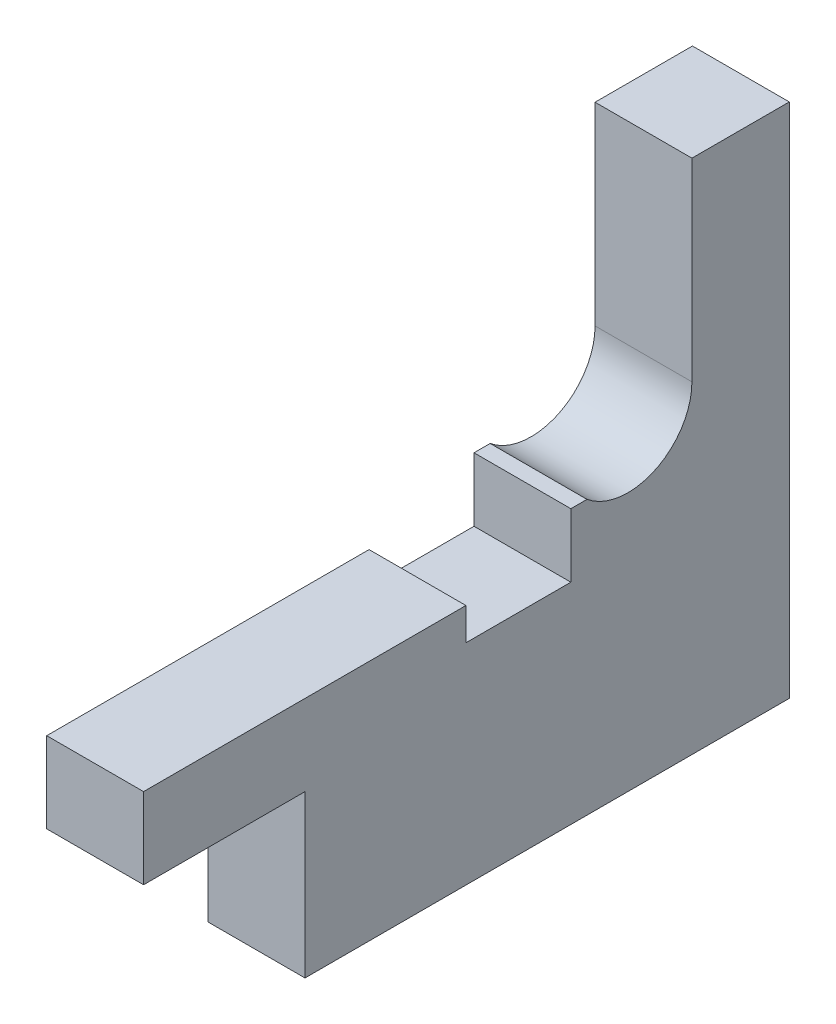
ISO-10303-21;
HEADER;
FILE_DESCRIPTION(('STEP AP214'),'2;1');
FILE_NAME('part.step','',(''),(''),'','','');
FILE_SCHEMA(('AUTOMOTIVE_DESIGN { 1 0 10303 214 1 1 1 1 }'));
ENDSEC;
DATA;
#1=APPLICATION_CONTEXT('core data for automotive mechanical design processes');
#2=APPLICATION_PROTOCOL_DEFINITION('international standard','automotive_design',2000,#1);
#3=PRODUCT_CONTEXT('',#1,'mechanical');
#4=PRODUCT('Part','Part','',(#3));
#5=PRODUCT_RELATED_PRODUCT_CATEGORY('part','',(#4));
#6=PRODUCT_DEFINITION_FORMATION('','',#4);
#7=PRODUCT_DEFINITION_CONTEXT('part definition',#1,'design');
#8=PRODUCT_DEFINITION('design','',#6,#7);
#9=PRODUCT_DEFINITION_SHAPE('','',#8);
#10=(LENGTH_UNIT() NAMED_UNIT(*) SI_UNIT(.MILLI.,.METRE.));
#11=(NAMED_UNIT(*) PLANE_ANGLE_UNIT() SI_UNIT($,.RADIAN.));
#12=(NAMED_UNIT(*) SI_UNIT($,.STERADIAN.) SOLID_ANGLE_UNIT());
#13=UNCERTAINTY_MEASURE_WITH_UNIT(LENGTH_MEASURE(1.E-05),#10,'distance_accuracy_value','');
#14=(GEOMETRIC_REPRESENTATION_CONTEXT(3) GLOBAL_UNCERTAINTY_ASSIGNED_CONTEXT((#13)) GLOBAL_UNIT_ASSIGNED_CONTEXT((#10,
#11,#12)) REPRESENTATION_CONTEXT('',''));
#15=CARTESIAN_POINT('',(0.,0.,0.));
#16=DIRECTION('',(0.,0.,1.));
#17=DIRECTION('',(1.,0.,0.));
#18=AXIS2_PLACEMENT_3D('',#15,#16,#17);
#19=CARTESIAN_POINT('',(6.,-3.05675481515937,3.53125));
#20=DIRECTION('',(0.,1.,0.));
#21=DIRECTION('',(0.,0.,1.));
#22=AXIS2_PLACEMENT_3D('',#19,#20,#21);
#23=PLANE('',#22);
#24=DIRECTION('',(0.,0.,-1.));
#25=VECTOR('',#24,1.);
#26=CARTESIAN_POINT('',(0.,-3.05675481515937,3.53125));
#27=LINE('',#26,#25);
#28=CARTESIAN_POINT('',(0.,-3.05675481515937,3.53125));
#29=VERTEX_POINT('',#28);
#30=CARTESIAN_POINT('',(0.,-3.05675481515937,2.53125));
#31=VERTEX_POINT('',#30);
#32=EDGE_CURVE('E178',#29,#31,#27,.T.);
#33=ORIENTED_EDGE('',*,*,#32,.F.);
#34=DIRECTION('',(-1.,0.,0.));
#35=VECTOR('',#34,1.);
#36=CARTESIAN_POINT('',(6.,-3.05675481515937,3.53125));
#37=LINE('',#36,#35);
#38=CARTESIAN_POINT('',(6.,-3.05675481515937,3.53125));
#39=VERTEX_POINT('',#38);
#40=EDGE_CURVE('E11',#39,#29,#37,.T.);
#41=ORIENTED_EDGE('',*,*,#40,.F.);
#42=DIRECTION('',(0.,0.,-1.));
#43=VECTOR('',#42,1.);
#44=CARTESIAN_POINT('',(6.,-3.05675481515937,3.53125));
#45=LINE('',#44,#43);
#46=CARTESIAN_POINT('',(6.,-3.05675481515937,2.53125));
#47=VERTEX_POINT('',#46);
#48=EDGE_CURVE('E226',#39,#47,#45,.T.);
#49=ORIENTED_EDGE('',*,*,#48,.T.);
#50=DIRECTION('',(-1.,0.,0.));
#51=VECTOR('',#50,1.);
#52=CARTESIAN_POINT('',(6.,-3.05675481515937,2.53125));
#53=LINE('',#52,#51);
#54=EDGE_CURVE('E48',#47,#31,#53,.T.);
#55=ORIENTED_EDGE('',*,*,#54,.T.);
#56=EDGE_LOOP('',(#33,#41,#49,#55));
#57=FACE_BOUND('',#56,.T.);
#58=ADVANCED_FACE('F45',(#57),#23,.T.);
#59=CARTESIAN_POINT('',(6.,-7.00000000000001,3.53125));
#60=DIRECTION('',(0.,0.,1.));
#61=DIRECTION('',(0.,-1.,0.));
#62=AXIS2_PLACEMENT_3D('',#59,#60,#61);
#63=PLANE('',#62);
#64=DIRECTION('',(0.,1.,0.));
#65=VECTOR('',#64,1.);
#66=CARTESIAN_POINT('',(0.,-7.00000000000001,3.53125));
#67=LINE('',#66,#65);
#68=CARTESIAN_POINT('',(0.,-7.00000000000001,3.53125));
#69=VERTEX_POINT('',#68);
#70=EDGE_CURVE('E223',#69,#29,#67,.T.);
#71=ORIENTED_EDGE('',*,*,#70,.F.);
#72=DIRECTION('',(-1.,0.,0.));
#73=VECTOR('',#72,1.);
#74=CARTESIAN_POINT('',(6.,-7.00000000000001,3.53125));
#75=LINE('',#74,#73);
#76=CARTESIAN_POINT('',(6.,-7.00000000000001,3.53125));
#77=VERTEX_POINT('',#76);
#78=EDGE_CURVE('E55',#77,#69,#75,.T.);
#79=ORIENTED_EDGE('',*,*,#78,.F.);
#80=DIRECTION('',(0.,1.,0.));
#81=VECTOR('',#80,1.);
#82=CARTESIAN_POINT('',(6.,-7.00000000000001,3.53125));
#83=LINE('',#82,#81);
#84=EDGE_CURVE('E164',#77,#39,#83,.T.);
#85=ORIENTED_EDGE('',*,*,#84,.T.);
#86=ORIENTED_EDGE('',*,*,#40,.T.);
#87=EDGE_LOOP('',(#71,#79,#85,#86));
#88=FACE_BOUND('',#87,.T.);
#89=ADVANCED_FACE('F259',(#88),#63,.T.);
#90=CARTESIAN_POINT('',(6.,-7.00000000000001,10.03125));
#91=DIRECTION('',(0.,1.,0.));
#92=DIRECTION('',(0.,0.,1.));
#93=AXIS2_PLACEMENT_3D('',#90,#91,#92);
#94=PLANE('',#93);
#95=DIRECTION('',(0.,0.,-1.));
#96=VECTOR('',#95,1.);
#97=CARTESIAN_POINT('',(0.,-7.00000000000001,10.03125));
#98=LINE('',#97,#96);
#99=CARTESIAN_POINT('',(0.,-7.00000000000001,10.03125));
#100=VERTEX_POINT('',#99);
#101=EDGE_CURVE('E150',#100,#69,#98,.T.);
#102=ORIENTED_EDGE('',*,*,#101,.F.);
#103=DIRECTION('',(-1.,0.,0.));
#104=VECTOR('',#103,1.);
#105=CARTESIAN_POINT('',(6.,-7.00000000000001,10.03125));
#106=LINE('',#105,#104);
#107=CARTESIAN_POINT('',(6.,-7.00000000000001,10.03125));
#108=VERTEX_POINT('',#107);
#109=EDGE_CURVE('E145',#108,#100,#106,.T.);
#110=ORIENTED_EDGE('',*,*,#109,.F.);
#111=DIRECTION('',(0.,0.,-1.));
#112=VECTOR('',#111,1.);
#113=CARTESIAN_POINT('',(6.,-7.00000000000001,10.03125));
#114=LINE('',#113,#112);
#115=EDGE_CURVE('E148',#108,#77,#114,.T.);
#116=ORIENTED_EDGE('',*,*,#115,.T.);
#117=ORIENTED_EDGE('',*,*,#78,.T.);
#118=EDGE_LOOP('',(#102,#110,#116,#117));
#119=FACE_BOUND('',#118,.T.);
#120=ADVANCED_FACE('F147',(#119),#94,.T.);
#121=CARTESIAN_POINT('',(6.,-5.00000000000001,10.03125));
#122=DIRECTION('',(0.,0.,-1.));
#123=DIRECTION('',(-1.,0.,0.));
#124=AXIS2_PLACEMENT_3D('',#121,#122,#123);
#125=PLANE('',#124);
#126=DIRECTION('',(0.,-1.,0.));
#127=VECTOR('',#126,1.);
#128=CARTESIAN_POINT('',(0.,-5.00000000000001,10.03125));
#129=LINE('',#128,#127);
#130=CARTESIAN_POINT('',(0.,-5.00000000000001,10.03125));
#131=VERTEX_POINT('',#130);
#132=EDGE_CURVE('E218',#131,#100,#129,.T.);
#133=ORIENTED_EDGE('',*,*,#132,.F.);
#134=DIRECTION('',(-1.,0.,0.));
#135=VECTOR('',#134,1.);
#136=CARTESIAN_POINT('',(6.,-5.00000000000001,10.03125));
#137=LINE('',#136,#135);
#138=CARTESIAN_POINT('',(6.,-5.00000000000001,10.03125));
#139=VERTEX_POINT('',#138);
#140=EDGE_CURVE('E156',#139,#131,#137,.T.);
#141=ORIENTED_EDGE('',*,*,#140,.F.);
#142=DIRECTION('',(0.,-1.,0.));
#143=VECTOR('',#142,1.);
#144=CARTESIAN_POINT('',(6.,-5.00000000000001,10.03125));
#145=LINE('',#144,#143);
#146=EDGE_CURVE('E162',#139,#108,#145,.T.);
#147=ORIENTED_EDGE('',*,*,#146,.T.);
#148=ORIENTED_EDGE('',*,*,#109,.T.);
#149=EDGE_LOOP('',(#133,#141,#147,#148));
#150=FACE_BOUND('',#149,.T.);
#151=ADVANCED_FACE('F167',(#150),#125,.T.);
#152=CARTESIAN_POINT('',(6.,-5.,30.));
#153=DIRECTION('',(0.,1.,0.));
#154=DIRECTION('',(0.,0.,1.));
#155=AXIS2_PLACEMENT_3D('',#152,#153,#154);
#156=PLANE('',#155);
#157=DIRECTION('',(0.,0.,-1.));
#158=VECTOR('',#157,1.);
#159=CARTESIAN_POINT('',(0.,-5.,30.));
#160=LINE('',#159,#158);
#161=CARTESIAN_POINT('',(0.,-5.,30.));
#162=VERTEX_POINT('',#161);
#163=EDGE_CURVE('E214',#162,#131,#160,.T.);
#164=ORIENTED_EDGE('',*,*,#163,.F.);
#165=DIRECTION('',(-1.,0.,0.));
#166=VECTOR('',#165,1.);
#167=CARTESIAN_POINT('',(6.,-5.,30.));
#168=LINE('',#167,#166);
#169=CARTESIAN_POINT('',(6.,-5.,30.));
#170=VERTEX_POINT('',#169);
#171=EDGE_CURVE('E232',#170,#162,#168,.T.);
#172=ORIENTED_EDGE('',*,*,#171,.F.);
#173=DIRECTION('',(0.,0.,-1.));
#174=VECTOR('',#173,1.);
#175=CARTESIAN_POINT('',(6.,-5.,30.));
#176=LINE('',#175,#174);
#177=EDGE_CURVE('E169',#170,#139,#176,.T.);
#178=ORIENTED_EDGE('',*,*,#177,.T.);
#179=ORIENTED_EDGE('',*,*,#140,.T.);
#180=EDGE_LOOP('',(#164,#172,#178,#179));
#181=FACE_BOUND('',#180,.T.);
#182=ADVANCED_FACE('F272',(#181),#156,.T.);
#183=CARTESIAN_POINT('',(6.,-10.,30.));
#184=DIRECTION('',(0.,0.,1.));
#185=DIRECTION('',(1.,0.,0.));
#186=AXIS2_PLACEMENT_3D('',#183,#184,#185);
#187=PLANE('',#186);
#188=DIRECTION('',(0.,1.,0.));
#189=VECTOR('',#188,1.);
#190=CARTESIAN_POINT('',(0.,-10.,30.));
#191=LINE('',#190,#189);
#192=CARTESIAN_POINT('',(0.,-10.,30.));
#193=VERTEX_POINT('',#192);
#194=EDGE_CURVE('E210',#193,#162,#191,.T.);
#195=ORIENTED_EDGE('',*,*,#194,.F.);
#196=DIRECTION('',(-1.,0.,0.));
#197=VECTOR('',#196,1.);
#198=CARTESIAN_POINT('',(6.,-10.,30.));
#199=LINE('',#198,#197);
#200=CARTESIAN_POINT('',(6.,-10.,30.));
#201=VERTEX_POINT('',#200);
#202=EDGE_CURVE('E235',#201,#193,#199,.T.);
#203=ORIENTED_EDGE('',*,*,#202,.F.);
#204=DIRECTION('',(0.,1.,0.));
#205=VECTOR('',#204,1.);
#206=CARTESIAN_POINT('',(6.,-10.,30.));
#207=LINE('',#206,#205);
#208=EDGE_CURVE('E172',#201,#170,#207,.T.);
#209=ORIENTED_EDGE('',*,*,#208,.T.);
#210=ORIENTED_EDGE('',*,*,#171,.T.);
#211=EDGE_LOOP('',(#195,#203,#209,#210));
#212=FACE_BOUND('',#211,.T.);
#213=ADVANCED_FACE('F275',(#212),#187,.T.);
#214=CARTESIAN_POINT('',(6.,-10.,20.));
#215=DIRECTION('',(0.,-1.,0.));
#216=DIRECTION('',(0.,0.,-1.));
#217=AXIS2_PLACEMENT_3D('',#214,#215,#216);
#218=PLANE('',#217);
#219=DIRECTION('',(0.,0.,1.));
#220=VECTOR('',#219,1.);
#221=CARTESIAN_POINT('',(0.,-10.,20.));
#222=LINE('',#221,#220);
#223=CARTESIAN_POINT('',(0.,-10.,20.));
#224=VERTEX_POINT('',#223);
#225=EDGE_CURVE('E206',#224,#193,#222,.T.);
#226=ORIENTED_EDGE('',*,*,#225,.F.);
#227=DIRECTION('',(-1.,0.,0.));
#228=VECTOR('',#227,1.);
#229=CARTESIAN_POINT('',(6.,-10.,20.));
#230=LINE('',#229,#228);
#231=CARTESIAN_POINT('',(6.,-10.,20.));
#232=VERTEX_POINT('',#231);
#233=EDGE_CURVE('E238',#232,#224,#230,.T.);
#234=ORIENTED_EDGE('',*,*,#233,.F.);
#235=DIRECTION('',(0.,0.,1.));
#236=VECTOR('',#235,1.);
#237=CARTESIAN_POINT('',(6.,-10.,20.));
#238=LINE('',#237,#236);
#239=EDGE_CURVE('E415',#232,#201,#238,.T.);
#240=ORIENTED_EDGE('',*,*,#239,.T.);
#241=ORIENTED_EDGE('',*,*,#202,.T.);
#242=EDGE_LOOP('',(#226,#234,#240,#241));
#243=FACE_BOUND('',#242,.T.);
#244=ADVANCED_FACE('F279',(#243),#218,.T.);
#245=CARTESIAN_POINT('',(6.,-20.,20.));
#246=DIRECTION('',(0.,0.,1.));
#247=DIRECTION('',(0.,-1.,0.));
#248=AXIS2_PLACEMENT_3D('',#245,#246,#247);
#249=PLANE('',#248);
#250=DIRECTION('',(0.,1.,0.));
#251=VECTOR('',#250,1.);
#252=CARTESIAN_POINT('',(0.,-20.,20.));
#253=LINE('',#252,#251);
#254=CARTESIAN_POINT('',(0.,-20.,20.));
#255=VERTEX_POINT('',#254);
#256=EDGE_CURVE('E202',#255,#224,#253,.T.);
#257=ORIENTED_EDGE('',*,*,#256,.F.);
#258=DIRECTION('',(-1.,0.,0.));
#259=VECTOR('',#258,1.);
#260=CARTESIAN_POINT('',(6.,-20.,20.));
#261=LINE('',#260,#259);
#262=CARTESIAN_POINT('',(6.,-20.,20.));
#263=VERTEX_POINT('',#262);
#264=EDGE_CURVE('E241',#263,#255,#261,.T.);
#265=ORIENTED_EDGE('',*,*,#264,.F.);
#266=DIRECTION('',(0.,1.,0.));
#267=VECTOR('',#266,1.);
#268=CARTESIAN_POINT('',(6.,-20.,20.));
#269=LINE('',#268,#267);
#270=EDGE_CURVE('E411',#263,#232,#269,.T.);
#271=ORIENTED_EDGE('',*,*,#270,.T.);
#272=ORIENTED_EDGE('',*,*,#233,.T.);
#273=EDGE_LOOP('',(#257,#265,#271,#272));
#274=FACE_BOUND('',#273,.T.);
#275=ADVANCED_FACE('F283',(#274),#249,.T.);
#276=CARTESIAN_POINT('',(6.,-20.,-10.));
#277=DIRECTION('',(0.,-1.,0.));
#278=DIRECTION('',(0.,0.,-1.));
#279=AXIS2_PLACEMENT_3D('',#276,#277,#278);
#280=PLANE('',#279);
#281=DIRECTION('',(0.,0.,1.));
#282=VECTOR('',#281,1.);
#283=CARTESIAN_POINT('',(0.,-20.,-10.));
#284=LINE('',#283,#282);
#285=CARTESIAN_POINT('',(0.,-20.,-10.));
#286=VERTEX_POINT('',#285);
#287=EDGE_CURVE('E198',#286,#255,#284,.T.);
#288=ORIENTED_EDGE('',*,*,#287,.F.);
#289=DIRECTION('',(-1.,0.,0.));
#290=VECTOR('',#289,1.);
#291=CARTESIAN_POINT('',(6.,-20.,-10.));
#292=LINE('',#291,#290);
#293=CARTESIAN_POINT('',(6.,-20.,-10.));
#294=VERTEX_POINT('',#293);
#295=EDGE_CURVE('E244',#294,#286,#292,.T.);
#296=ORIENTED_EDGE('',*,*,#295,.F.);
#297=DIRECTION('',(0.,0.,1.));
#298=VECTOR('',#297,1.);
#299=CARTESIAN_POINT('',(6.,-20.,-10.));
#300=LINE('',#299,#298);
#301=EDGE_CURVE('E425',#294,#263,#300,.T.);
#302=ORIENTED_EDGE('',*,*,#301,.T.);
#303=ORIENTED_EDGE('',*,*,#264,.T.);
#304=EDGE_LOOP('',(#288,#296,#302,#303));
#305=FACE_BOUND('',#304,.T.);
#306=ADVANCED_FACE('F287',(#305),#280,.T.);
#307=CARTESIAN_POINT('',(6.,12.,-10.));
#308=DIRECTION('',(0.,0.,-1.));
#309=DIRECTION('',(0.,1.,0.));
#310=AXIS2_PLACEMENT_3D('',#307,#308,#309);
#311=PLANE('',#310);
#312=DIRECTION('',(0.,-1.,0.));
#313=VECTOR('',#312,1.);
#314=CARTESIAN_POINT('',(0.,12.,-10.));
#315=LINE('',#314,#313);
#316=CARTESIAN_POINT('',(0.,12.,-10.));
#317=VERTEX_POINT('',#316);
#318=EDGE_CURVE('E194',#317,#286,#315,.T.);
#319=ORIENTED_EDGE('',*,*,#318,.F.);
#320=DIRECTION('',(-1.,0.,0.));
#321=VECTOR('',#320,1.);
#322=CARTESIAN_POINT('',(6.,12.,-10.));
#323=LINE('',#322,#321);
#324=CARTESIAN_POINT('',(6.,12.,-10.));
#325=VERTEX_POINT('',#324);
#326=EDGE_CURVE('E247',#325,#317,#323,.T.);
#327=ORIENTED_EDGE('',*,*,#326,.F.);
#328=DIRECTION('',(0.,-1.,0.));
#329=VECTOR('',#328,1.);
#330=CARTESIAN_POINT('',(6.,12.,-10.));
#331=LINE('',#330,#329);
#332=EDGE_CURVE('E404',#325,#294,#331,.T.);
#333=ORIENTED_EDGE('',*,*,#332,.T.);
#334=ORIENTED_EDGE('',*,*,#295,.T.);
#335=EDGE_LOOP('',(#319,#327,#333,#334));
#336=FACE_BOUND('',#335,.T.);
#337=ADVANCED_FACE('F291',(#336),#311,.T.);
#338=CARTESIAN_POINT('',(6.,12.,-3.96875));
#339=DIRECTION('',(0.,1.,0.));
#340=DIRECTION('',(0.,0.,1.));
#341=AXIS2_PLACEMENT_3D('',#338,#339,#340);
#342=PLANE('',#341);
#343=DIRECTION('',(0.,0.,-1.));
#344=VECTOR('',#343,1.);
#345=CARTESIAN_POINT('',(0.,12.,-3.96875));
#346=LINE('',#345,#344);
#347=CARTESIAN_POINT('',(0.,12.,-3.96875));
#348=VERTEX_POINT('',#347);
#349=EDGE_CURVE('E190',#348,#317,#346,.T.);
#350=ORIENTED_EDGE('',*,*,#349,.F.);
#351=DIRECTION('',(-1.,0.,0.));
#352=VECTOR('',#351,1.);
#353=CARTESIAN_POINT('',(6.,12.,-3.96875));
#354=LINE('',#353,#352);
#355=CARTESIAN_POINT('',(6.,12.,-3.96875));
#356=VERTEX_POINT('',#355);
#357=EDGE_CURVE('E250',#356,#348,#354,.T.);
#358=ORIENTED_EDGE('',*,*,#357,.F.);
#359=DIRECTION('',(0.,0.,-1.));
#360=VECTOR('',#359,1.);
#361=CARTESIAN_POINT('',(6.,12.,-3.96875));
#362=LINE('',#361,#360);
#363=EDGE_CURVE('E400',#356,#325,#362,.T.);
#364=ORIENTED_EDGE('',*,*,#363,.T.);
#365=ORIENTED_EDGE('',*,*,#326,.T.);
#366=EDGE_LOOP('',(#350,#358,#364,#365));
#367=FACE_BOUND('',#366,.T.);
#368=ADVANCED_FACE('F295',(#367),#342,.T.);
#369=CARTESIAN_POINT('',(6.,0.,-3.96875));
#370=DIRECTION('',(0.,0.,1.));
#371=DIRECTION('',(1.,0.,0.));
#372=AXIS2_PLACEMENT_3D('',#369,#370,#371);
#373=PLANE('',#372);
#374=DIRECTION('',(0.,1.,0.));
#375=VECTOR('',#374,1.);
#376=CARTESIAN_POINT('',(0.,0.,-3.96875));
#377=LINE('',#376,#375);
#378=CARTESIAN_POINT('',(0.,0.,-3.96875));
#379=VERTEX_POINT('',#378);
#380=EDGE_CURVE('E186',#379,#348,#377,.T.);
#381=ORIENTED_EDGE('',*,*,#380,.F.);
#382=DIRECTION('',(-1.,0.,0.));
#383=VECTOR('',#382,1.);
#384=CARTESIAN_POINT('',(6.,0.,-3.96875));
#385=LINE('',#384,#383);
#386=CARTESIAN_POINT('',(6.,0.,-3.96875));
#387=VERTEX_POINT('',#386);
#388=EDGE_CURVE('E252',#387,#379,#385,.T.);
#389=ORIENTED_EDGE('',*,*,#388,.F.);
#390=DIRECTION('',(0.,1.,0.));
#391=VECTOR('',#390,1.);
#392=CARTESIAN_POINT('',(6.,0.,-3.96875));
#393=LINE('',#392,#391);
#394=EDGE_CURVE('E432',#387,#356,#393,.T.);
#395=ORIENTED_EDGE('',*,*,#394,.T.);
#396=ORIENTED_EDGE('',*,*,#357,.T.);
#397=EDGE_LOOP('',(#381,#389,#395,#396));
#398=FACE_BOUND('',#397,.T.);
#399=ADVANCED_FACE('F299',(#398),#373,.T.);
#400=CARTESIAN_POINT('',(6.,0.,0.));
#401=DIRECTION('',(-1.,0.,0.));
#402=DIRECTION('',(0.,0.,1.));
#403=AXIS2_PLACEMENT_3D('',#400,#401,#402);
#404=CYLINDRICAL_SURFACE('',#403,3.96875);
#405=CARTESIAN_POINT('',(0.,0.,0.));
#406=DIRECTION('',(1.,0.,0.));
#407=DIRECTION('',(0.,0.,-1.));
#408=AXIS2_PLACEMENT_3D('',#405,#406,#407);
#409=CIRCLE('',#408,3.96875);
#410=EDGE_CURVE('E182',#31,#379,#409,.T.);
#411=ORIENTED_EDGE('',*,*,#410,.F.);
#412=ORIENTED_EDGE('',*,*,#54,.F.);
#413=CARTESIAN_POINT('',(6.,0.,0.));
#414=DIRECTION('',(1.,0.,0.));
#415=DIRECTION('',(0.,0.,-1.));
#416=AXIS2_PLACEMENT_3D('',#413,#414,#415);
#417=CIRCLE('',#416,3.96875);
#418=EDGE_CURVE('E435',#47,#387,#417,.T.);
#419=ORIENTED_EDGE('',*,*,#418,.T.);
#420=ORIENTED_EDGE('',*,*,#388,.T.);
#421=EDGE_LOOP('',(#411,#412,#419,#420));
#422=FACE_BOUND('',#421,.T.);
#423=ADVANCED_FACE('F256',(#422),#404,.F.);
#424=CARTESIAN_POINT('',(6.,0.,0.));
#425=DIRECTION('',(1.,0.,0.));
#426=DIRECTION('',(0.,0.,-1.));
#427=AXIS2_PLACEMENT_3D('',#424,#425,#426);
#428=PLANE('',#427);
#429=ORIENTED_EDGE('',*,*,#48,.F.);
#430=ORIENTED_EDGE('',*,*,#84,.F.);
#431=ORIENTED_EDGE('',*,*,#115,.F.);
#432=ORIENTED_EDGE('',*,*,#146,.F.);
#433=ORIENTED_EDGE('',*,*,#177,.F.);
#434=ORIENTED_EDGE('',*,*,#208,.F.);
#435=ORIENTED_EDGE('',*,*,#239,.F.);
#436=ORIENTED_EDGE('',*,*,#270,.F.);
#437=ORIENTED_EDGE('',*,*,#301,.F.);
#438=ORIENTED_EDGE('',*,*,#332,.F.);
#439=ORIENTED_EDGE('',*,*,#363,.F.);
#440=ORIENTED_EDGE('',*,*,#394,.F.);
#441=ORIENTED_EDGE('',*,*,#418,.F.);
#442=EDGE_LOOP('',(#429,#430,#431,#432,#433,#434,#435,#436,#437,#438,#439,#440,#441));
#443=FACE_BOUND('',#442,.T.);
#444=ADVANCED_FACE('F160',(#443),#428,.T.);
#445=CARTESIAN_POINT('',(0.,0.,0.));
#446=DIRECTION('',(1.,0.,0.));
#447=DIRECTION('',(0.,0.,-1.));
#448=AXIS2_PLACEMENT_3D('',#445,#446,#447);
#449=PLANE('',#448);
#450=ORIENTED_EDGE('',*,*,#32,.T.);
#451=ORIENTED_EDGE('',*,*,#410,.T.);
#452=ORIENTED_EDGE('',*,*,#380,.T.);
#453=ORIENTED_EDGE('',*,*,#349,.T.);
#454=ORIENTED_EDGE('',*,*,#318,.T.);
#455=ORIENTED_EDGE('',*,*,#287,.T.);
#456=ORIENTED_EDGE('',*,*,#256,.T.);
#457=ORIENTED_EDGE('',*,*,#225,.T.);
#458=ORIENTED_EDGE('',*,*,#194,.T.);
#459=ORIENTED_EDGE('',*,*,#163,.T.);
#460=ORIENTED_EDGE('',*,*,#132,.T.);
#461=ORIENTED_EDGE('',*,*,#101,.T.);
#462=ORIENTED_EDGE('',*,*,#70,.T.);
#463=EDGE_LOOP('',(#450,#451,#452,#453,#454,#455,#456,#457,#458,#459,#460,#461,#462));
#464=FACE_BOUND('',#463,.T.);
#465=ADVANCED_FACE('F258',(#464),#449,.F.);
#466=CLOSED_SHELL('',(#58,#89,#120,#151,#182,#213,#244,#275,#306,#337,#368,#399,#423,#444,#465));
#467=MANIFOLD_SOLID_BREP('B2',#466);
#468=ADVANCED_BREP_SHAPE_REPRESENTATION('',(#18,#467),#14);
#469=SHAPE_DEFINITION_REPRESENTATION(#9,#468);
ENDSEC;
END-ISO-10303-21;
